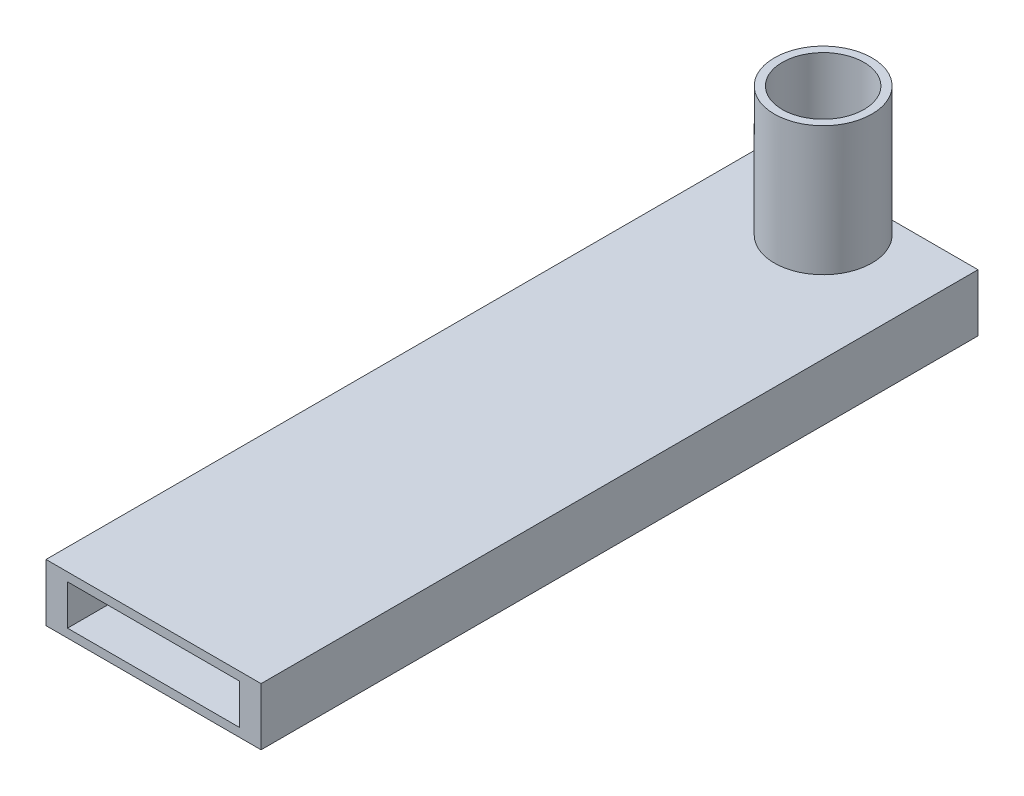
ISO-10303-21;
HEADER;
FILE_DESCRIPTION(('STEP AP214'),'2;1');
FILE_NAME('part.step','',(''),(''),'','','');
FILE_SCHEMA(('AUTOMOTIVE_DESIGN { 1 0 10303 214 1 1 1 1 }'));
ENDSEC;
DATA;
#1=APPLICATION_CONTEXT('core data for automotive mechanical design processes');
#2=APPLICATION_PROTOCOL_DEFINITION('international standard','automotive_design',2000,#1);
#3=PRODUCT_CONTEXT('',#1,'mechanical');
#4=PRODUCT('Part','Part','',(#3));
#5=PRODUCT_RELATED_PRODUCT_CATEGORY('part','',(#4));
#6=PRODUCT_DEFINITION_FORMATION('','',#4);
#7=PRODUCT_DEFINITION_CONTEXT('part definition',#1,'design');
#8=PRODUCT_DEFINITION('design','',#6,#7);
#9=PRODUCT_DEFINITION_SHAPE('','',#8);
#10=(LENGTH_UNIT() NAMED_UNIT(*) SI_UNIT(.MILLI.,.METRE.));
#11=(NAMED_UNIT(*) PLANE_ANGLE_UNIT() SI_UNIT($,.RADIAN.));
#12=(NAMED_UNIT(*) SI_UNIT($,.STERADIAN.) SOLID_ANGLE_UNIT());
#13=UNCERTAINTY_MEASURE_WITH_UNIT(LENGTH_MEASURE(1.E-05),#10,'distance_accuracy_value','');
#14=(GEOMETRIC_REPRESENTATION_CONTEXT(3) GLOBAL_UNCERTAINTY_ASSIGNED_CONTEXT((#13)) GLOBAL_UNIT_ASSIGNED_CONTEXT((#10,
#11,#12)) REPRESENTATION_CONTEXT('',''));
#15=CARTESIAN_POINT('',(0.,0.,0.));
#16=DIRECTION('',(0.,0.,1.));
#17=DIRECTION('',(1.,0.,0.));
#18=AXIS2_PLACEMENT_3D('',#15,#16,#17);
#19=CARTESIAN_POINT('',(19.05,-5.08,-127.));
#20=DIRECTION('',(1.,0.,0.));
#21=DIRECTION('',(0.,0.,-1.));
#22=AXIS2_PLACEMENT_3D('',#19,#20,#21);
#23=PLANE('',#22);
#24=DIRECTION('',(0.,1.,0.));
#25=VECTOR('',#24,1.);
#26=CARTESIAN_POINT('',(19.05,-5.08,0.));
#27=LINE('',#26,#25);
#28=CARTESIAN_POINT('',(19.05,-5.08,0.));
#29=VERTEX_POINT('',#28);
#30=CARTESIAN_POINT('',(19.05,5.08,0.));
#31=VERTEX_POINT('',#30);
#32=EDGE_CURVE('E160',#29,#31,#27,.T.);
#33=ORIENTED_EDGE('',*,*,#32,.F.);
#34=DIRECTION('',(0.,0.,1.));
#35=VECTOR('',#34,1.);
#36=CARTESIAN_POINT('',(19.05,-5.08,-127.));
#37=LINE('',#36,#35);
#38=CARTESIAN_POINT('',(19.05,-5.08,-127.));
#39=VERTEX_POINT('',#38);
#40=EDGE_CURVE('E40',#39,#29,#37,.T.);
#41=ORIENTED_EDGE('',*,*,#40,.F.);
#42=DIRECTION('',(0.,1.,0.));
#43=VECTOR('',#42,1.);
#44=CARTESIAN_POINT('',(19.05,-5.08,-127.));
#45=LINE('',#44,#43);
#46=CARTESIAN_POINT('',(19.05,5.08,-127.));
#47=VERTEX_POINT('',#46);
#48=EDGE_CURVE('E166',#39,#47,#45,.T.);
#49=ORIENTED_EDGE('',*,*,#48,.T.);
#50=DIRECTION('',(0.,0.,1.));
#51=VECTOR('',#50,1.);
#52=CARTESIAN_POINT('',(19.05,5.08,-127.));
#53=LINE('',#52,#51);
#54=EDGE_CURVE('E105',#47,#31,#53,.T.);
#55=ORIENTED_EDGE('',*,*,#54,.T.);
#56=EDGE_LOOP('',(#33,#41,#49,#55));
#57=FACE_BOUND('',#56,.T.);
#58=ADVANCED_FACE('F32',(#57),#23,.T.);
#59=CARTESIAN_POINT('',(-19.05,-5.08,-127.));
#60=DIRECTION('',(0.,-1.,0.));
#61=DIRECTION('',(0.,0.,-1.));
#62=AXIS2_PLACEMENT_3D('',#59,#60,#61);
#63=PLANE('',#62);
#64=CARTESIAN_POINT('',(0.,-5.08,-118.618));
#65=DIRECTION('',(0.,-1.,0.));
#66=DIRECTION('',(0.,0.,-1.));
#67=AXIS2_PLACEMENT_3D('',#64,#65,#66);
#68=CIRCLE('',#67,5.207);
#69=CARTESIAN_POINT('',(0.,-5.08,-123.825));
#70=VERTEX_POINT('',#69);
#71=EDGE_CURVE('E125',#70,#70,#68,.T.);
#72=ORIENTED_EDGE('',*,*,#71,.F.);
#73=EDGE_LOOP('',(#72));
#74=FACE_BOUND('',#73,.T.);
#75=DIRECTION('',(1.,0.,0.));
#76=VECTOR('',#75,1.);
#77=CARTESIAN_POINT('',(-19.05,-5.08,0.));
#78=LINE('',#77,#76);
#79=CARTESIAN_POINT('',(-19.05,-5.08,0.));
#80=VERTEX_POINT('',#79);
#81=EDGE_CURVE('E167',#80,#29,#78,.T.);
#82=ORIENTED_EDGE('',*,*,#81,.F.);
#83=DIRECTION('',(0.,0.,1.));
#84=VECTOR('',#83,1.);
#85=CARTESIAN_POINT('',(-19.05,-5.08,-127.));
#86=LINE('',#85,#84);
#87=CARTESIAN_POINT('',(-19.05,-5.08,-127.));
#88=VERTEX_POINT('',#87);
#89=EDGE_CURVE('E185',#88,#80,#86,.T.);
#90=ORIENTED_EDGE('',*,*,#89,.F.);
#91=DIRECTION('',(1.,0.,0.));
#92=VECTOR('',#91,1.);
#93=CARTESIAN_POINT('',(-19.05,-5.08,-127.));
#94=LINE('',#93,#92);
#95=EDGE_CURVE('E171',#88,#39,#94,.T.);
#96=ORIENTED_EDGE('',*,*,#95,.T.);
#97=ORIENTED_EDGE('',*,*,#40,.T.);
#98=EDGE_LOOP('',(#82,#90,#96,#97));
#99=FACE_BOUND('',#98,.T.);
#100=ADVANCED_FACE('F196',(#74,#99),#63,.T.);
#101=CARTESIAN_POINT('',(-19.05,-5.08,-127.));
#102=DIRECTION('',(-1.,0.,0.));
#103=DIRECTION('',(0.,0.,1.));
#104=AXIS2_PLACEMENT_3D('',#101,#102,#103);
#105=PLANE('',#104);
#106=DIRECTION('',(0.,-1.,0.));
#107=VECTOR('',#106,1.);
#108=CARTESIAN_POINT('',(-19.05,-5.08,0.));
#109=LINE('',#108,#107);
#110=CARTESIAN_POINT('',(-19.05,5.08,0.));
#111=VERTEX_POINT('',#110);
#112=EDGE_CURVE('E179',#111,#80,#109,.T.);
#113=ORIENTED_EDGE('',*,*,#112,.F.);
#114=DIRECTION('',(0.,0.,1.));
#115=VECTOR('',#114,1.);
#116=CARTESIAN_POINT('',(-19.05,5.08,-127.));
#117=LINE('',#116,#115);
#118=CARTESIAN_POINT('',(-19.05,5.08,-127.));
#119=VERTEX_POINT('',#118);
#120=EDGE_CURVE('E187',#119,#111,#117,.T.);
#121=ORIENTED_EDGE('',*,*,#120,.F.);
#122=DIRECTION('',(0.,-1.,0.));
#123=VECTOR('',#122,1.);
#124=CARTESIAN_POINT('',(-19.05,-5.08,-127.));
#125=LINE('',#124,#123);
#126=EDGE_CURVE('E109',#119,#88,#125,.T.);
#127=ORIENTED_EDGE('',*,*,#126,.T.);
#128=ORIENTED_EDGE('',*,*,#89,.T.);
#129=EDGE_LOOP('',(#113,#121,#127,#128));
#130=FACE_BOUND('',#129,.T.);
#131=ADVANCED_FACE('F199',(#130),#105,.T.);
#132=CARTESIAN_POINT('',(-19.05,5.08,-127.));
#133=DIRECTION('',(0.,1.,0.));
#134=DIRECTION('',(0.,0.,1.));
#135=AXIS2_PLACEMENT_3D('',#132,#133,#134);
#136=PLANE('',#135);
#137=CARTESIAN_POINT('',(0.,5.08,-118.618));
#138=DIRECTION('',(0.,1.,0.));
#139=DIRECTION('',(0.,0.,1.));
#140=AXIS2_PLACEMENT_3D('',#137,#138,#139);
#141=CIRCLE('',#140,8.641264268908);
#142=CARTESIAN_POINT('',(-2.100838919362,5.08,-127.));
#143=VERTEX_POINT('',#142);
#144=CARTESIAN_POINT('',(2.10083891936201,5.08,-127.));
#145=VERTEX_POINT('',#144);
#146=EDGE_CURVE('E11',#143,#145,#141,.T.);
#147=ORIENTED_EDGE('',*,*,#146,.F.);
#148=DIRECTION('',(-1.,0.,0.));
#149=VECTOR('',#148,1.);
#150=CARTESIAN_POINT('',(-19.05,5.08,-127.));
#151=LINE('',#150,#149);
#152=EDGE_CURVE('E112',#143,#119,#151,.T.);
#153=ORIENTED_EDGE('',*,*,#152,.T.);
#154=ORIENTED_EDGE('',*,*,#120,.T.);
#155=DIRECTION('',(-1.,0.,0.));
#156=VECTOR('',#155,1.);
#157=CARTESIAN_POINT('',(-19.05,5.08,0.));
#158=LINE('',#157,#156);
#159=EDGE_CURVE('E176',#31,#111,#158,.T.);
#160=ORIENTED_EDGE('',*,*,#159,.F.);
#161=ORIENTED_EDGE('',*,*,#54,.F.);
#162=EDGE_CURVE('E101',#47,#145,#151,.T.);
#163=ORIENTED_EDGE('',*,*,#162,.T.);
#164=EDGE_LOOP('',(#147,#153,#154,#160,#161,#163));
#165=FACE_BOUND('',#164,.T.);
#166=ADVANCED_FACE('F103',(#165),#136,.T.);
#167=CARTESIAN_POINT('',(0.,0.,-127.));
#168=DIRECTION('',(0.,0.,-1.));
#169=DIRECTION('',(-1.,0.,0.));
#170=AXIS2_PLACEMENT_3D('',#167,#168,#169);
#171=PLANE('',#170);
#172=ORIENTED_EDGE('',*,*,#48,.F.);
#173=ORIENTED_EDGE('',*,*,#95,.F.);
#174=ORIENTED_EDGE('',*,*,#126,.F.);
#175=ORIENTED_EDGE('',*,*,#152,.F.);
#176=EDGE_CURVE('E110',#145,#143,#151,.T.);
#177=ORIENTED_EDGE('',*,*,#176,.F.);
#178=ORIENTED_EDGE('',*,*,#162,.F.);
#179=EDGE_LOOP('',(#172,#173,#174,#175,#177,#178));
#180=FACE_BOUND('',#179,.T.);
#181=ADVANCED_FACE('F114',(#180),#171,.T.);
#182=CARTESIAN_POINT('',(0.,0.,0.));
#183=DIRECTION('',(0.,0.,-1.));
#184=DIRECTION('',(-1.,0.,0.));
#185=AXIS2_PLACEMENT_3D('',#182,#183,#184);
#186=PLANE('',#185);
#187=DIRECTION('',(-1.,0.,0.));
#188=VECTOR('',#187,1.);
#189=CARTESIAN_POINT('',(-15.24,3.556,0.));
#190=LINE('',#189,#188);
#191=CARTESIAN_POINT('',(15.24,3.556,0.));
#192=VERTEX_POINT('',#191);
#193=CARTESIAN_POINT('',(-15.24,3.556,0.));
#194=VERTEX_POINT('',#193);
#195=EDGE_CURVE('E150',#192,#194,#190,.T.);
#196=ORIENTED_EDGE('',*,*,#195,.F.);
#197=DIRECTION('',(0.,1.,0.));
#198=VECTOR('',#197,1.);
#199=CARTESIAN_POINT('',(15.24,-3.556,0.));
#200=LINE('',#199,#198);
#201=CARTESIAN_POINT('',(15.24,-3.556,0.));
#202=VERTEX_POINT('',#201);
#203=EDGE_CURVE('E55',#202,#192,#200,.T.);
#204=ORIENTED_EDGE('',*,*,#203,.F.);
#205=DIRECTION('',(1.,0.,0.));
#206=VECTOR('',#205,1.);
#207=CARTESIAN_POINT('',(-15.24,-3.556,0.));
#208=LINE('',#207,#206);
#209=CARTESIAN_POINT('',(-15.24,-3.556,0.));
#210=VERTEX_POINT('',#209);
#211=EDGE_CURVE('E139',#210,#202,#208,.T.);
#212=ORIENTED_EDGE('',*,*,#211,.F.);
#213=DIRECTION('',(0.,-1.,0.));
#214=VECTOR('',#213,1.);
#215=CARTESIAN_POINT('',(-15.24,-3.556,0.));
#216=LINE('',#215,#214);
#217=EDGE_CURVE('E153',#194,#210,#216,.T.);
#218=ORIENTED_EDGE('',*,*,#217,.F.);
#219=EDGE_LOOP('',(#196,#204,#212,#218));
#220=FACE_BOUND('',#219,.T.);
#221=ORIENTED_EDGE('',*,*,#32,.T.);
#222=ORIENTED_EDGE('',*,*,#159,.T.);
#223=ORIENTED_EDGE('',*,*,#112,.T.);
#224=ORIENTED_EDGE('',*,*,#81,.T.);
#225=EDGE_LOOP('',(#221,#222,#223,#224));
#226=FACE_BOUND('',#225,.T.);
#227=ADVANCED_FACE('F193',(#220,#226),#186,.F.);
#228=CARTESIAN_POINT('',(15.24,-3.556,-25.4));
#229=DIRECTION('',(1.,0.,0.));
#230=DIRECTION('',(0.,0.,-1.));
#231=AXIS2_PLACEMENT_3D('',#228,#229,#230);
#232=PLANE('',#231);
#233=ORIENTED_EDGE('',*,*,#203,.T.);
#234=DIRECTION('',(0.,0.,1.));
#235=VECTOR('',#234,1.);
#236=CARTESIAN_POINT('',(15.24,3.556,-25.4));
#237=LINE('',#236,#235);
#238=CARTESIAN_POINT('',(15.24,3.556,-25.4));
#239=VERTEX_POINT('',#238);
#240=EDGE_CURVE('E148',#239,#192,#237,.T.);
#241=ORIENTED_EDGE('',*,*,#240,.F.);
#242=DIRECTION('',(0.,1.,0.));
#243=VECTOR('',#242,1.);
#244=CARTESIAN_POINT('',(15.24,-3.556,-25.4));
#245=LINE('',#244,#243);
#246=CARTESIAN_POINT('',(15.24,-3.556,-25.4));
#247=VERTEX_POINT('',#246);
#248=EDGE_CURVE('E135',#247,#239,#245,.T.);
#249=ORIENTED_EDGE('',*,*,#248,.F.);
#250=DIRECTION('',(0.,0.,1.));
#251=VECTOR('',#250,1.);
#252=CARTESIAN_POINT('',(15.24,-3.556,-25.4));
#253=LINE('',#252,#251);
#254=EDGE_CURVE('E158',#247,#202,#253,.T.);
#255=ORIENTED_EDGE('',*,*,#254,.T.);
#256=EDGE_LOOP('',(#233,#241,#249,#255));
#257=FACE_BOUND('',#256,.T.);
#258=ADVANCED_FACE('F310',(#257),#232,.F.);
#259=CARTESIAN_POINT('',(-15.24,-3.556,-25.4));
#260=DIRECTION('',(0.,-1.,0.));
#261=DIRECTION('',(0.,0.,-1.));
#262=AXIS2_PLACEMENT_3D('',#259,#260,#261);
#263=PLANE('',#262);
#264=ORIENTED_EDGE('',*,*,#211,.T.);
#265=ORIENTED_EDGE('',*,*,#254,.F.);
#266=DIRECTION('',(1.,0.,0.));
#267=VECTOR('',#266,1.);
#268=CARTESIAN_POINT('',(-15.24,-3.556,-25.4));
#269=LINE('',#268,#267);
#270=CARTESIAN_POINT('',(-15.24,-3.556,-25.4));
#271=VERTEX_POINT('',#270);
#272=EDGE_CURVE('E145',#271,#247,#269,.T.);
#273=ORIENTED_EDGE('',*,*,#272,.F.);
#274=DIRECTION('',(0.,0.,1.));
#275=VECTOR('',#274,1.);
#276=CARTESIAN_POINT('',(-15.24,-3.556,-25.4));
#277=LINE('',#276,#275);
#278=EDGE_CURVE('E161',#271,#210,#277,.T.);
#279=ORIENTED_EDGE('',*,*,#278,.T.);
#280=EDGE_LOOP('',(#264,#265,#273,#279));
#281=FACE_BOUND('',#280,.T.);
#282=ADVANCED_FACE('F306',(#281),#263,.F.);
#283=CARTESIAN_POINT('',(-15.24,-3.556,-25.4));
#284=DIRECTION('',(-1.,0.,0.));
#285=DIRECTION('',(0.,0.,1.));
#286=AXIS2_PLACEMENT_3D('',#283,#284,#285);
#287=PLANE('',#286);
#288=ORIENTED_EDGE('',*,*,#217,.T.);
#289=ORIENTED_EDGE('',*,*,#278,.F.);
#290=DIRECTION('',(0.,-1.,0.));
#291=VECTOR('',#290,1.);
#292=CARTESIAN_POINT('',(-15.24,-3.556,-25.4));
#293=LINE('',#292,#291);
#294=CARTESIAN_POINT('',(-15.24,3.556,-25.4));
#295=VERTEX_POINT('',#294);
#296=EDGE_CURVE('E142',#295,#271,#293,.T.);
#297=ORIENTED_EDGE('',*,*,#296,.F.);
#298=DIRECTION('',(0.,0.,1.));
#299=VECTOR('',#298,1.);
#300=CARTESIAN_POINT('',(-15.24,3.556,-25.4));
#301=LINE('',#300,#299);
#302=EDGE_CURVE('E163',#295,#194,#301,.T.);
#303=ORIENTED_EDGE('',*,*,#302,.T.);
#304=EDGE_LOOP('',(#288,#289,#297,#303));
#305=FACE_BOUND('',#304,.T.);
#306=ADVANCED_FACE('F309',(#305),#287,.F.);
#307=CARTESIAN_POINT('',(-15.24,3.556,-25.4));
#308=DIRECTION('',(0.,1.,0.));
#309=DIRECTION('',(0.,0.,1.));
#310=AXIS2_PLACEMENT_3D('',#307,#308,#309);
#311=PLANE('',#310);
#312=ORIENTED_EDGE('',*,*,#195,.T.);
#313=ORIENTED_EDGE('',*,*,#302,.F.);
#314=DIRECTION('',(-1.,0.,0.));
#315=VECTOR('',#314,1.);
#316=CARTESIAN_POINT('',(-15.24,3.556,-25.4));
#317=LINE('',#316,#315);
#318=EDGE_CURVE('E138',#239,#295,#317,.T.);
#319=ORIENTED_EDGE('',*,*,#318,.F.);
#320=ORIENTED_EDGE('',*,*,#240,.T.);
#321=EDGE_LOOP('',(#312,#313,#319,#320));
#322=FACE_BOUND('',#321,.T.);
#323=ADVANCED_FACE('F304',(#322),#311,.F.);
#324=CARTESIAN_POINT('',(0.,0.,-25.4));
#325=DIRECTION('',(0.,0.,-1.));
#326=DIRECTION('',(-1.,0.,0.));
#327=AXIS2_PLACEMENT_3D('',#324,#325,#326);
#328=PLANE('',#327);
#329=ORIENTED_EDGE('',*,*,#248,.T.);
#330=ORIENTED_EDGE('',*,*,#318,.T.);
#331=ORIENTED_EDGE('',*,*,#296,.T.);
#332=ORIENTED_EDGE('',*,*,#272,.T.);
#333=EDGE_LOOP('',(#329,#330,#331,#332));
#334=FACE_BOUND('',#333,.T.);
#335=ADVANCED_FACE('F222',(#334),#328,.F.);
#336=CARTESIAN_POINT('',(0.,-1.27,-118.618));
#337=DIRECTION('',(0.,1.,0.));
#338=DIRECTION('',(0.,0.,1.));
#339=AXIS2_PLACEMENT_3D('',#336,#337,#338);
#340=CYLINDRICAL_SURFACE('',#339,7.239);
#341=CARTESIAN_POINT('',(0.,-1.27,-118.618));
#342=DIRECTION('',(0.,1.,0.));
#343=DIRECTION('',(0.,0.,1.));
#344=AXIS2_PLACEMENT_3D('',#341,#342,#343);
#345=CIRCLE('',#344,7.239);
#346=CARTESIAN_POINT('',(0.,-1.27,-111.379));
#347=VERTEX_POINT('',#346);
#348=EDGE_CURVE('E132',#347,#347,#345,.T.);
#349=ORIENTED_EDGE('',*,*,#348,.F.);
#350=EDGE_LOOP('',(#349));
#351=FACE_BOUND('',#350,.T.);
#352=CARTESIAN_POINT('',(0.,27.94,-118.618));
#353=DIRECTION('',(0.,1.,0.));
#354=DIRECTION('',(0.,0.,1.));
#355=AXIS2_PLACEMENT_3D('',#352,#353,#354);
#356=CIRCLE('',#355,7.239);
#357=CARTESIAN_POINT('',(0.,27.94,-111.379));
#358=VERTEX_POINT('',#357);
#359=EDGE_CURVE('E123',#358,#358,#356,.T.);
#360=ORIENTED_EDGE('',*,*,#359,.T.);
#361=EDGE_LOOP('',(#360));
#362=FACE_BOUND('',#361,.T.);
#363=ADVANCED_FACE('F233',(#351,#362),#340,.F.);
#364=CARTESIAN_POINT('',(0.,-1.27,-118.618));
#365=DIRECTION('',(0.,1.,0.));
#366=DIRECTION('',(0.,0.,1.));
#367=AXIS2_PLACEMENT_3D('',#364,#365,#366);
#368=PLANE('',#367);
#369=CARTESIAN_POINT('',(0.,-1.27,-118.618));
#370=DIRECTION('',(0.,1.,0.));
#371=DIRECTION('',(0.,0.,1.));
#372=AXIS2_PLACEMENT_3D('',#369,#370,#371);
#373=CIRCLE('',#372,5.207);
#374=CARTESIAN_POINT('',(0.,-1.27,-113.411));
#375=VERTEX_POINT('',#374);
#376=EDGE_CURVE('E35',#375,#375,#373,.T.);
#377=ORIENTED_EDGE('',*,*,#376,.F.);
#378=EDGE_LOOP('',(#377));
#379=FACE_BOUND('',#378,.T.);
#380=ORIENTED_EDGE('',*,*,#348,.T.);
#381=EDGE_LOOP('',(#380));
#382=FACE_BOUND('',#381,.T.);
#383=ADVANCED_FACE('F227',(#379,#382),#368,.T.);
#384=CARTESIAN_POINT('',(0.,5.08,-118.618));
#385=DIRECTION('',(0.,-1.,0.));
#386=DIRECTION('',(0.,0.,-1.));
#387=AXIS2_PLACEMENT_3D('',#384,#385,#386);
#388=CYLINDRICAL_SURFACE('',#387,5.207);
#389=ORIENTED_EDGE('',*,*,#376,.T.);
#390=EDGE_LOOP('',(#389));
#391=FACE_BOUND('',#390,.T.);
#392=ORIENTED_EDGE('',*,*,#71,.T.);
#393=EDGE_LOOP('',(#392));
#394=FACE_BOUND('',#393,.T.);
#395=ADVANCED_FACE('F232',(#391,#394),#388,.F.);
#396=CARTESIAN_POINT('',(0.,27.94,-118.618));
#397=DIRECTION('',(0.,1.,0.));
#398=DIRECTION('',(0.,0.,1.));
#399=AXIS2_PLACEMENT_3D('',#396,#397,#398);
#400=PLANE('',#399);
#401=ORIENTED_EDGE('',*,*,#359,.F.);
#402=EDGE_LOOP('',(#401));
#403=FACE_BOUND('',#402,.T.);
#404=CARTESIAN_POINT('',(0.,27.94,-118.618));
#405=DIRECTION('',(0.,1.,0.));
#406=DIRECTION('',(0.,0.,1.));
#407=AXIS2_PLACEMENT_3D('',#404,#405,#406);
#408=CIRCLE('',#407,8.641264268908);
#409=CARTESIAN_POINT('',(0.,27.94,-109.976735731092));
#410=VERTEX_POINT('',#409);
#411=EDGE_CURVE('E122',#410,#410,#408,.T.);
#412=ORIENTED_EDGE('',*,*,#411,.T.);
#413=EDGE_LOOP('',(#412));
#414=FACE_BOUND('',#413,.T.);
#415=ADVANCED_FACE('F245',(#403,#414),#400,.T.);
#416=CARTESIAN_POINT('',(0.,27.94,-118.618));
#417=DIRECTION('',(0.,-1.,0.));
#418=DIRECTION('',(0.,0.,-1.));
#419=AXIS2_PLACEMENT_3D('',#416,#417,#418);
#420=CYLINDRICAL_SURFACE('',#419,8.641264268908);
#421=ORIENTED_EDGE('',*,*,#411,.F.);
#422=EDGE_LOOP('',(#421));
#423=FACE_BOUND('',#422,.T.);
#424=EDGE_CURVE('E42',#145,#143,#141,.T.);
#425=ORIENTED_EDGE('',*,*,#424,.T.);
#426=ORIENTED_EDGE('',*,*,#146,.T.);
#427=EDGE_LOOP('',(#425,#426));
#428=FACE_BOUND('',#427,.T.);
#429=ADVANCED_FACE('F120',(#423,#428),#420,.T.);
#430=CARTESIAN_POINT('',(0.,5.08,-118.618));
#431=DIRECTION('',(0.,1.,0.));
#432=DIRECTION('',(0.,0.,1.));
#433=AXIS2_PLACEMENT_3D('',#430,#431,#432);
#434=PLANE('',#433);
#435=ORIENTED_EDGE('',*,*,#424,.F.);
#436=ORIENTED_EDGE('',*,*,#176,.T.);
#437=EDGE_LOOP('',(#435,#436));
#438=FACE_BOUND('',#437,.T.);
#439=ADVANCED_FACE('F121',(#438),#434,.F.);
#440=CLOSED_SHELL('',(#58,#100,#131,#166,#181,#227,#258,#282,#306,#323,#335,#363,#383,#395,#415,
#429,#439));
#441=MANIFOLD_SOLID_BREP('B2',#440);
#442=ADVANCED_BREP_SHAPE_REPRESENTATION('',(#18,#441),#14);
#443=SHAPE_DEFINITION_REPRESENTATION(#9,#442);
ENDSEC;
END-ISO-10303-21;
